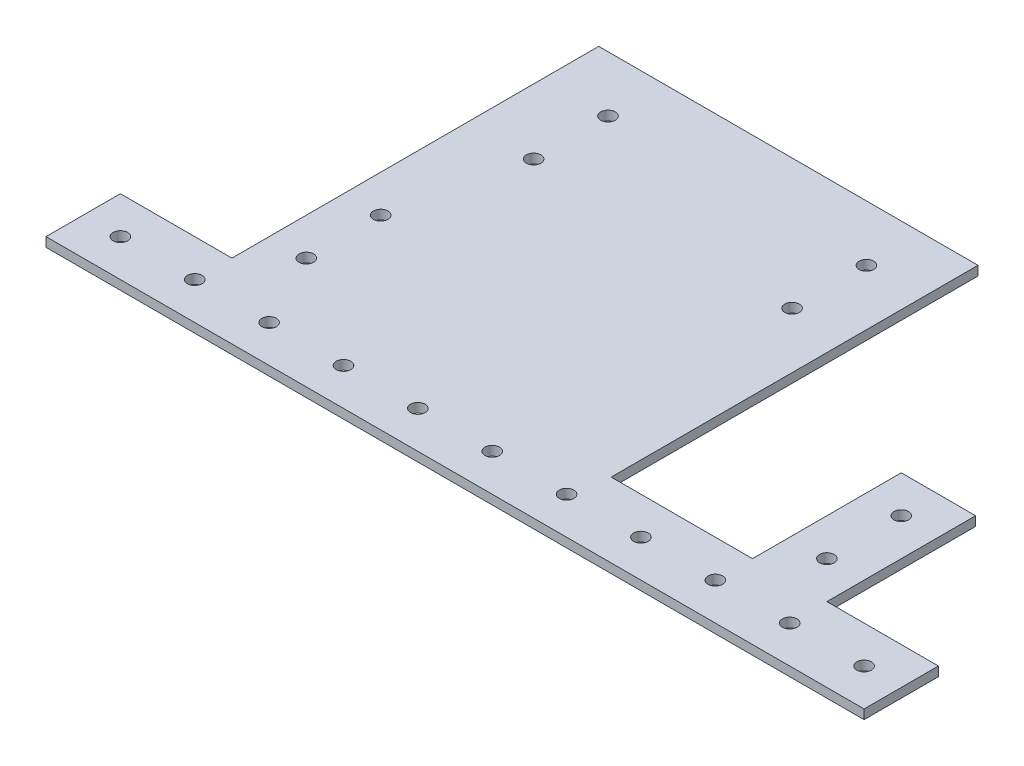
ISO-10303-21;
HEADER;
FILE_DESCRIPTION(('STEP AP214'),'2;1');
FILE_NAME('part.step','',(''),(''),'','','');
FILE_SCHEMA(('AUTOMOTIVE_DESIGN { 1 0 10303 214 1 1 1 1 }'));
ENDSEC;
DATA;
#1=APPLICATION_CONTEXT('core data for automotive mechanical design processes');
#2=APPLICATION_PROTOCOL_DEFINITION('international standard','automotive_design',2000,#1);
#3=PRODUCT_CONTEXT('',#1,'mechanical');
#4=PRODUCT('Part','Part','',(#3));
#5=PRODUCT_RELATED_PRODUCT_CATEGORY('part','',(#4));
#6=PRODUCT_DEFINITION_FORMATION('','',#4);
#7=PRODUCT_DEFINITION_CONTEXT('part definition',#1,'design');
#8=PRODUCT_DEFINITION('design','',#6,#7);
#9=PRODUCT_DEFINITION_SHAPE('','',#8);
#10=(LENGTH_UNIT() NAMED_UNIT(*) SI_UNIT(.MILLI.,.METRE.));
#11=(NAMED_UNIT(*) PLANE_ANGLE_UNIT() SI_UNIT($,.RADIAN.));
#12=(NAMED_UNIT(*) SI_UNIT($,.STERADIAN.) SOLID_ANGLE_UNIT());
#13=UNCERTAINTY_MEASURE_WITH_UNIT(LENGTH_MEASURE(1.E-05),#10,'distance_accuracy_value','');
#14=(GEOMETRIC_REPRESENTATION_CONTEXT(3) GLOBAL_UNCERTAINTY_ASSIGNED_CONTEXT((#13)) GLOBAL_UNIT_ASSIGNED_CONTEXT((#10,
#11,#12)) REPRESENTATION_CONTEXT('',''));
#15=CARTESIAN_POINT('',(0.,0.,0.));
#16=DIRECTION('',(0.,0.,1.));
#17=DIRECTION('',(1.,0.,0.));
#18=AXIS2_PLACEMENT_3D('',#15,#16,#17);
#19=CARTESIAN_POINT('',(0.,3.175,0.));
#20=DIRECTION('',(0.,-1.,0.));
#21=DIRECTION('',(0.,0.,-1.));
#22=AXIS2_PLACEMENT_3D('',#19,#20,#21);
#23=PLANE('',#22);
#24=DIRECTION('',(0.,0.,1.));
#25=VECTOR('',#24,1.);
#26=CARTESIAN_POINT('',(-101.6,3.175,-25.4));
#27=LINE('',#26,#25);
#28=CARTESIAN_POINT('',(-101.6,3.175,-150.6728));
#29=VERTEX_POINT('',#28);
#30=CARTESIAN_POINT('',(-101.6,3.175,-25.4));
#31=VERTEX_POINT('',#30);
#32=EDGE_CURVE('E177',#29,#31,#27,.T.);
#33=ORIENTED_EDGE('',*,*,#32,.T.);
#34=DIRECTION('',(-1.,0.,0.));
#35=VECTOR('',#34,1.);
#36=CARTESIAN_POINT('',(-139.7,3.175,-25.4));
#37=LINE('',#36,#35);
#38=CARTESIAN_POINT('',(-139.7,3.175,-25.4));
#39=VERTEX_POINT('',#38);
#40=EDGE_CURVE('E105',#31,#39,#37,.T.);
#41=ORIENTED_EDGE('',*,*,#40,.T.);
#42=DIRECTION('',(0.,0.,1.));
#43=VECTOR('',#42,1.);
#44=CARTESIAN_POINT('',(-139.7,3.175,0.));
#45=LINE('',#44,#43);
#46=CARTESIAN_POINT('',(-139.7,3.175,0.));
#47=VERTEX_POINT('',#46);
#48=EDGE_CURVE('E204',#39,#47,#45,.T.);
#49=ORIENTED_EDGE('',*,*,#48,.T.);
#50=DIRECTION('',(1.,0.,0.));
#51=VECTOR('',#50,1.);
#52=CARTESIAN_POINT('',(139.7,3.175,0.));
#53=LINE('',#52,#51);
#54=CARTESIAN_POINT('',(139.7,3.175,0.));
#55=VERTEX_POINT('',#54);
#56=EDGE_CURVE('E223',#47,#55,#53,.T.);
#57=ORIENTED_EDGE('',*,*,#56,.T.);
#58=DIRECTION('',(0.,0.,-1.));
#59=VECTOR('',#58,1.);
#60=CARTESIAN_POINT('',(139.7,3.175,0.));
#61=LINE('',#60,#59);
#62=CARTESIAN_POINT('',(139.7,3.175,-25.4000000000001));
#63=VERTEX_POINT('',#62);
#64=EDGE_CURVE('E220',#55,#63,#61,.T.);
#65=ORIENTED_EDGE('',*,*,#64,.T.);
#66=DIRECTION('',(-1.,0.,0.));
#67=VECTOR('',#66,1.);
#68=CARTESIAN_POINT('',(139.7,3.175,-25.4000000000001));
#69=LINE('',#68,#67);
#70=CARTESIAN_POINT('',(101.6,3.175,-25.4));
#71=VERTEX_POINT('',#70);
#72=EDGE_CURVE('E222',#63,#71,#69,.T.);
#73=ORIENTED_EDGE('',*,*,#72,.T.);
#74=DIRECTION('',(0.,0.,-1.));
#75=VECTOR('',#74,1.);
#76=CARTESIAN_POINT('',(101.6,3.175,-25.4));
#77=LINE('',#76,#75);
#78=CARTESIAN_POINT('',(101.6,3.175,-76.2));
#79=VERTEX_POINT('',#78);
#80=EDGE_CURVE('E225',#71,#79,#77,.T.);
#81=ORIENTED_EDGE('',*,*,#80,.T.);
#82=DIRECTION('',(-1.,0.,0.));
#83=VECTOR('',#82,1.);
#84=CARTESIAN_POINT('',(76.1999999999999,3.175,-76.2));
#85=LINE('',#84,#83);
#86=CARTESIAN_POINT('',(76.1999999999999,3.175,-76.2));
#87=VERTEX_POINT('',#86);
#88=EDGE_CURVE('E231',#79,#87,#85,.T.);
#89=ORIENTED_EDGE('',*,*,#88,.T.);
#90=DIRECTION('',(0.,0.,1.));
#91=VECTOR('',#90,1.);
#92=CARTESIAN_POINT('',(76.1999999999999,3.175,-25.4));
#93=LINE('',#92,#91);
#94=CARTESIAN_POINT('',(76.1999999999999,3.175,-25.4));
#95=VERTEX_POINT('',#94);
#96=EDGE_CURVE('E136',#87,#95,#93,.T.);
#97=ORIENTED_EDGE('',*,*,#96,.T.);
#98=DIRECTION('',(-1.,0.,0.));
#99=VECTOR('',#98,1.);
#100=CARTESIAN_POINT('',(27.9400000000001,3.175,-25.3999999999999));
#101=LINE('',#100,#99);
#102=CARTESIAN_POINT('',(27.9400000000001,3.175,-25.3999999999999));
#103=VERTEX_POINT('',#102);
#104=EDGE_CURVE('E130',#95,#103,#101,.T.);
#105=ORIENTED_EDGE('',*,*,#104,.T.);
#106=DIRECTION('',(0.,0.,-1.));
#107=VECTOR('',#106,1.);
#108=CARTESIAN_POINT('',(27.9399999999999,3.175,-150.6728));
#109=LINE('',#108,#107);
#110=CARTESIAN_POINT('',(27.9399999999999,3.175,-150.6728));
#111=VERTEX_POINT('',#110);
#112=EDGE_CURVE('E134',#103,#111,#109,.T.);
#113=ORIENTED_EDGE('',*,*,#112,.T.);
#114=DIRECTION('',(-1.,0.,0.));
#115=VECTOR('',#114,1.);
#116=CARTESIAN_POINT('',(-101.6,3.175,-150.6728));
#117=LINE('',#116,#115);
#118=EDGE_CURVE('E50',#111,#29,#117,.T.);
#119=ORIENTED_EDGE('',*,*,#118,.T.);
#120=EDGE_LOOP('',(#33,#41,#49,#57,#65,#73,#81,#89,#97,#105,#113,#119));
#121=FACE_BOUND('',#120,.T.);
#122=CARTESIAN_POINT('',(-127.,3.175,-12.7));
#123=DIRECTION('',(0.,1.,0.));
#124=DIRECTION('',(0.,0.,1.));
#125=AXIS2_PLACEMENT_3D('',#122,#123,#124);
#126=CIRCLE('',#125,2.4892);
#127=CARTESIAN_POINT('',(-127.,3.175,-10.2108));
#128=VERTEX_POINT('',#127);
#129=EDGE_CURVE('E158',#128,#128,#126,.T.);
#130=ORIENTED_EDGE('',*,*,#129,.F.);
#131=EDGE_LOOP('',(#130));
#132=FACE_BOUND('',#131,.T.);
#133=CARTESIAN_POINT('',(-88.8999999999999,3.175,-38.1));
#134=DIRECTION('',(0.,1.,0.));
#135=DIRECTION('',(0.,0.,1.));
#136=AXIS2_PLACEMENT_3D('',#133,#134,#135);
#137=CIRCLE('',#136,2.4892);
#138=CARTESIAN_POINT('',(-88.8999999999999,3.175,-35.6108));
#139=VERTEX_POINT('',#138);
#140=EDGE_CURVE('E445',#139,#139,#137,.T.);
#141=ORIENTED_EDGE('',*,*,#140,.F.);
#142=EDGE_LOOP('',(#141));
#143=FACE_BOUND('',#142,.T.);
#144=CARTESIAN_POINT('',(-88.8999999999999,3.175,-63.5));
#145=DIRECTION('',(0.,1.,0.));
#146=DIRECTION('',(0.,0.,1.));
#147=AXIS2_PLACEMENT_3D('',#144,#145,#146);
#148=CIRCLE('',#147,2.4892);
#149=CARTESIAN_POINT('',(-88.8999999999999,3.175,-61.0108));
#150=VERTEX_POINT('',#149);
#151=EDGE_CURVE('E439',#150,#150,#148,.T.);
#152=ORIENTED_EDGE('',*,*,#151,.F.);
#153=EDGE_LOOP('',(#152));
#154=FACE_BOUND('',#153,.T.);
#155=CARTESIAN_POINT('',(-79.375,3.175,-131.6228));
#156=DIRECTION('',(0.,1.,0.));
#157=DIRECTION('',(0.,0.,1.));
#158=AXIS2_PLACEMENT_3D('',#155,#156,#157);
#159=CIRCLE('',#158,2.48920000000002);
#160=CARTESIAN_POINT('',(-79.375,3.175,-129.1336));
#161=VERTEX_POINT('',#160);
#162=EDGE_CURVE('E433',#161,#161,#159,.T.);
#163=ORIENTED_EDGE('',*,*,#162,.F.);
#164=EDGE_LOOP('',(#163));
#165=FACE_BOUND('',#164,.T.);
#166=CARTESIAN_POINT('',(-79.375,3.175,-106.2228));
#167=DIRECTION('',(0.,1.,0.));
#168=DIRECTION('',(0.,0.,1.));
#169=AXIS2_PLACEMENT_3D('',#166,#167,#168);
#170=CIRCLE('',#169,2.4892);
#171=CARTESIAN_POINT('',(-79.375,3.175,-103.7336));
#172=VERTEX_POINT('',#171);
#173=EDGE_CURVE('E427',#172,#172,#170,.T.);
#174=ORIENTED_EDGE('',*,*,#173,.F.);
#175=EDGE_LOOP('',(#174));
#176=FACE_BOUND('',#175,.T.);
#177=CARTESIAN_POINT('',(8.88999999999996,3.175,-106.2228));
#178=DIRECTION('',(0.,1.,0.));
#179=DIRECTION('',(0.,0.,1.));
#180=AXIS2_PLACEMENT_3D('',#177,#178,#179);
#181=CIRCLE('',#180,2.48919999999999);
#182=CARTESIAN_POINT('',(8.88999999999996,3.175,-103.7336));
#183=VERTEX_POINT('',#182);
#184=EDGE_CURVE('E421',#183,#183,#181,.T.);
#185=ORIENTED_EDGE('',*,*,#184,.F.);
#186=EDGE_LOOP('',(#185));
#187=FACE_BOUND('',#186,.T.);
#188=CARTESIAN_POINT('',(8.88999999999995,3.175,-131.6228));
#189=DIRECTION('',(0.,1.,0.));
#190=DIRECTION('',(0.,0.,1.));
#191=AXIS2_PLACEMENT_3D('',#188,#189,#190);
#192=CIRCLE('',#191,2.48920000000002);
#193=CARTESIAN_POINT('',(8.88999999999995,3.175,-129.1336));
#194=VERTEX_POINT('',#193);
#195=EDGE_CURVE('E415',#194,#194,#192,.T.);
#196=ORIENTED_EDGE('',*,*,#195,.F.);
#197=EDGE_LOOP('',(#196));
#198=FACE_BOUND('',#197,.T.);
#199=CARTESIAN_POINT('',(88.8999999999999,3.175,-63.5));
#200=DIRECTION('',(0.,1.,0.));
#201=DIRECTION('',(0.,0.,1.));
#202=AXIS2_PLACEMENT_3D('',#199,#200,#201);
#203=CIRCLE('',#202,2.48920000000002);
#204=CARTESIAN_POINT('',(88.8999999999999,3.175,-61.0108));
#205=VERTEX_POINT('',#204);
#206=EDGE_CURVE('E409',#205,#205,#203,.T.);
#207=ORIENTED_EDGE('',*,*,#206,.F.);
#208=EDGE_LOOP('',(#207));
#209=FACE_BOUND('',#208,.T.);
#210=CARTESIAN_POINT('',(88.8999999999999,3.175,-38.1));
#211=DIRECTION('',(0.,1.,0.));
#212=DIRECTION('',(0.,0.,1.));
#213=AXIS2_PLACEMENT_3D('',#210,#211,#212);
#214=CIRCLE('',#213,2.4892);
#215=CARTESIAN_POINT('',(88.8999999999999,3.175,-35.6108));
#216=VERTEX_POINT('',#215);
#217=EDGE_CURVE('E403',#216,#216,#214,.T.);
#218=ORIENTED_EDGE('',*,*,#217,.F.);
#219=EDGE_LOOP('',(#218));
#220=FACE_BOUND('',#219,.T.);
#221=CARTESIAN_POINT('',(-101.6,3.175,-12.7));
#222=DIRECTION('',(0.,1.,0.));
#223=DIRECTION('',(0.,0.,1.));
#224=AXIS2_PLACEMENT_3D('',#221,#222,#223);
#225=CIRCLE('',#224,2.4892);
#226=CARTESIAN_POINT('',(-101.6,3.175,-10.2108));
#227=VERTEX_POINT('',#226);
#228=EDGE_CURVE('E397',#227,#227,#225,.T.);
#229=ORIENTED_EDGE('',*,*,#228,.F.);
#230=EDGE_LOOP('',(#229));
#231=FACE_BOUND('',#230,.T.);
#232=CARTESIAN_POINT('',(-76.2,3.175,-12.7));
#233=DIRECTION('',(0.,1.,0.));
#234=DIRECTION('',(0.,0.,1.));
#235=AXIS2_PLACEMENT_3D('',#232,#233,#234);
#236=CIRCLE('',#235,2.4892);
#237=CARTESIAN_POINT('',(-76.2,3.175,-10.2108));
#238=VERTEX_POINT('',#237);
#239=EDGE_CURVE('E391',#238,#238,#236,.T.);
#240=ORIENTED_EDGE('',*,*,#239,.F.);
#241=EDGE_LOOP('',(#240));
#242=FACE_BOUND('',#241,.T.);
#243=CARTESIAN_POINT('',(-50.8,3.175,-12.7));
#244=DIRECTION('',(0.,1.,0.));
#245=DIRECTION('',(0.,0.,1.));
#246=AXIS2_PLACEMENT_3D('',#243,#244,#245);
#247=CIRCLE('',#246,2.4892);
#248=CARTESIAN_POINT('',(-50.8,3.175,-10.2108));
#249=VERTEX_POINT('',#248);
#250=EDGE_CURVE('E385',#249,#249,#247,.T.);
#251=ORIENTED_EDGE('',*,*,#250,.F.);
#252=EDGE_LOOP('',(#251));
#253=FACE_BOUND('',#252,.T.);
#254=CARTESIAN_POINT('',(-25.4,3.175,-12.7));
#255=DIRECTION('',(0.,1.,0.));
#256=DIRECTION('',(0.,0.,1.));
#257=AXIS2_PLACEMENT_3D('',#254,#255,#256);
#258=CIRCLE('',#257,2.4892);
#259=CARTESIAN_POINT('',(-25.4,3.175,-10.2108));
#260=VERTEX_POINT('',#259);
#261=EDGE_CURVE('E379',#260,#260,#258,.T.);
#262=ORIENTED_EDGE('',*,*,#261,.F.);
#263=EDGE_LOOP('',(#262));
#264=FACE_BOUND('',#263,.T.);
#265=CARTESIAN_POINT('',(0.,3.175,-12.7));
#266=DIRECTION('',(0.,1.,0.));
#267=DIRECTION('',(0.,0.,1.));
#268=AXIS2_PLACEMENT_3D('',#265,#266,#267);
#269=CIRCLE('',#268,2.4892);
#270=CARTESIAN_POINT('',(0.,3.175,-10.2108));
#271=VERTEX_POINT('',#270);
#272=EDGE_CURVE('E373',#271,#271,#269,.T.);
#273=ORIENTED_EDGE('',*,*,#272,.F.);
#274=EDGE_LOOP('',(#273));
#275=FACE_BOUND('',#274,.T.);
#276=CARTESIAN_POINT('',(25.4,3.175,-12.7));
#277=DIRECTION('',(0.,1.,0.));
#278=DIRECTION('',(0.,0.,1.));
#279=AXIS2_PLACEMENT_3D('',#276,#277,#278);
#280=CIRCLE('',#279,2.4892);
#281=CARTESIAN_POINT('',(25.4,3.175,-10.2108));
#282=VERTEX_POINT('',#281);
#283=EDGE_CURVE('E367',#282,#282,#280,.T.);
#284=ORIENTED_EDGE('',*,*,#283,.F.);
#285=EDGE_LOOP('',(#284));
#286=FACE_BOUND('',#285,.T.);
#287=CARTESIAN_POINT('',(50.8,3.175,-12.7));
#288=DIRECTION('',(0.,1.,0.));
#289=DIRECTION('',(0.,0.,1.));
#290=AXIS2_PLACEMENT_3D('',#287,#288,#289);
#291=CIRCLE('',#290,2.4892);
#292=CARTESIAN_POINT('',(50.8,3.175,-10.2108));
#293=VERTEX_POINT('',#292);
#294=EDGE_CURVE('E361',#293,#293,#291,.T.);
#295=ORIENTED_EDGE('',*,*,#294,.F.);
#296=EDGE_LOOP('',(#295));
#297=FACE_BOUND('',#296,.T.);
#298=CARTESIAN_POINT('',(76.2,3.175,-12.7));
#299=DIRECTION('',(0.,1.,0.));
#300=DIRECTION('',(0.,0.,1.));
#301=AXIS2_PLACEMENT_3D('',#298,#299,#300);
#302=CIRCLE('',#301,2.4892);
#303=CARTESIAN_POINT('',(76.2,3.175,-10.2108));
#304=VERTEX_POINT('',#303);
#305=EDGE_CURVE('E355',#304,#304,#302,.T.);
#306=ORIENTED_EDGE('',*,*,#305,.F.);
#307=EDGE_LOOP('',(#306));
#308=FACE_BOUND('',#307,.T.);
#309=CARTESIAN_POINT('',(101.6,3.175,-12.7));
#310=DIRECTION('',(0.,1.,0.));
#311=DIRECTION('',(0.,0.,1.));
#312=AXIS2_PLACEMENT_3D('',#309,#310,#311);
#313=CIRCLE('',#312,2.4892);
#314=CARTESIAN_POINT('',(101.6,3.175,-10.2108));
#315=VERTEX_POINT('',#314);
#316=EDGE_CURVE('E349',#315,#315,#313,.T.);
#317=ORIENTED_EDGE('',*,*,#316,.F.);
#318=EDGE_LOOP('',(#317));
#319=FACE_BOUND('',#318,.T.);
#320=CARTESIAN_POINT('',(127.,3.175,-12.7));
#321=DIRECTION('',(0.,1.,0.));
#322=DIRECTION('',(0.,0.,1.));
#323=AXIS2_PLACEMENT_3D('',#320,#321,#322);
#324=CIRCLE('',#323,2.4892);
#325=CARTESIAN_POINT('',(127.,3.175,-10.2108));
#326=VERTEX_POINT('',#325);
#327=EDGE_CURVE('E340',#326,#326,#324,.T.);
#328=ORIENTED_EDGE('',*,*,#327,.F.);
#329=EDGE_LOOP('',(#328));
#330=FACE_BOUND('',#329,.T.);
#331=ADVANCED_FACE('F33',(#121,#132,#143,#154,#165,#176,#187,#198,#209,#220,#231,#242,#253,#264,
#275,#286,#297,#308,#319,#330),#23,.F.);
#332=CARTESIAN_POINT('',(0.,0.,0.));
#333=DIRECTION('',(0.,-1.,0.));
#334=DIRECTION('',(0.,0.,-1.));
#335=AXIS2_PLACEMENT_3D('',#332,#333,#334);
#336=PLANE('',#335);
#337=CARTESIAN_POINT('',(101.6,0.,-12.7));
#338=DIRECTION('',(0.,1.,0.));
#339=DIRECTION('',(0.,0.,1.));
#340=AXIS2_PLACEMENT_3D('',#337,#338,#339);
#341=CIRCLE('',#340,2.4892);
#342=CARTESIAN_POINT('',(101.6,0.,-10.2108));
#343=VERTEX_POINT('',#342);
#344=EDGE_CURVE('E346',#343,#343,#341,.T.);
#345=ORIENTED_EDGE('',*,*,#344,.T.);
#346=EDGE_LOOP('',(#345));
#347=FACE_BOUND('',#346,.T.);
#348=CARTESIAN_POINT('',(50.8,0.,-12.7));
#349=DIRECTION('',(0.,1.,0.));
#350=DIRECTION('',(0.,0.,1.));
#351=AXIS2_PLACEMENT_3D('',#348,#349,#350);
#352=CIRCLE('',#351,2.4892);
#353=CARTESIAN_POINT('',(50.8,0.,-10.2108));
#354=VERTEX_POINT('',#353);
#355=EDGE_CURVE('E358',#354,#354,#352,.T.);
#356=ORIENTED_EDGE('',*,*,#355,.T.);
#357=EDGE_LOOP('',(#356));
#358=FACE_BOUND('',#357,.T.);
#359=CARTESIAN_POINT('',(0.,0.,-12.7));
#360=DIRECTION('',(0.,1.,0.));
#361=DIRECTION('',(0.,0.,1.));
#362=AXIS2_PLACEMENT_3D('',#359,#360,#361);
#363=CIRCLE('',#362,2.4892);
#364=CARTESIAN_POINT('',(0.,0.,-10.2108));
#365=VERTEX_POINT('',#364);
#366=EDGE_CURVE('E370',#365,#365,#363,.T.);
#367=ORIENTED_EDGE('',*,*,#366,.T.);
#368=EDGE_LOOP('',(#367));
#369=FACE_BOUND('',#368,.T.);
#370=CARTESIAN_POINT('',(-50.8,0.,-12.7));
#371=DIRECTION('',(0.,1.,0.));
#372=DIRECTION('',(0.,0.,1.));
#373=AXIS2_PLACEMENT_3D('',#370,#371,#372);
#374=CIRCLE('',#373,2.4892);
#375=CARTESIAN_POINT('',(-50.8,0.,-10.2108));
#376=VERTEX_POINT('',#375);
#377=EDGE_CURVE('E382',#376,#376,#374,.T.);
#378=ORIENTED_EDGE('',*,*,#377,.T.);
#379=EDGE_LOOP('',(#378));
#380=FACE_BOUND('',#379,.T.);
#381=CARTESIAN_POINT('',(-101.6,0.,-12.7));
#382=DIRECTION('',(0.,1.,0.));
#383=DIRECTION('',(0.,0.,1.));
#384=AXIS2_PLACEMENT_3D('',#381,#382,#383);
#385=CIRCLE('',#384,2.4892);
#386=CARTESIAN_POINT('',(-101.6,0.,-10.2108));
#387=VERTEX_POINT('',#386);
#388=EDGE_CURVE('E394',#387,#387,#385,.T.);
#389=ORIENTED_EDGE('',*,*,#388,.T.);
#390=EDGE_LOOP('',(#389));
#391=FACE_BOUND('',#390,.T.);
#392=CARTESIAN_POINT('',(88.8999999999999,0.,-63.5));
#393=DIRECTION('',(0.,1.,0.));
#394=DIRECTION('',(0.,0.,1.));
#395=AXIS2_PLACEMENT_3D('',#392,#393,#394);
#396=CIRCLE('',#395,2.48920000000002);
#397=CARTESIAN_POINT('',(88.8999999999999,0.,-61.0108));
#398=VERTEX_POINT('',#397);
#399=EDGE_CURVE('E406',#398,#398,#396,.T.);
#400=ORIENTED_EDGE('',*,*,#399,.T.);
#401=EDGE_LOOP('',(#400));
#402=FACE_BOUND('',#401,.T.);
#403=CARTESIAN_POINT('',(8.88999999999996,0.,-106.2228));
#404=DIRECTION('',(0.,1.,0.));
#405=DIRECTION('',(0.,0.,1.));
#406=AXIS2_PLACEMENT_3D('',#403,#404,#405);
#407=CIRCLE('',#406,2.48919999999999);
#408=CARTESIAN_POINT('',(8.88999999999996,0.,-103.7336));
#409=VERTEX_POINT('',#408);
#410=EDGE_CURVE('E418',#409,#409,#407,.T.);
#411=ORIENTED_EDGE('',*,*,#410,.T.);
#412=EDGE_LOOP('',(#411));
#413=FACE_BOUND('',#412,.T.);
#414=CARTESIAN_POINT('',(-79.375,0.,-131.6228));
#415=DIRECTION('',(0.,1.,0.));
#416=DIRECTION('',(0.,0.,1.));
#417=AXIS2_PLACEMENT_3D('',#414,#415,#416);
#418=CIRCLE('',#417,2.48920000000002);
#419=CARTESIAN_POINT('',(-79.375,0.,-129.1336));
#420=VERTEX_POINT('',#419);
#421=EDGE_CURVE('E430',#420,#420,#418,.T.);
#422=ORIENTED_EDGE('',*,*,#421,.T.);
#423=EDGE_LOOP('',(#422));
#424=FACE_BOUND('',#423,.T.);
#425=CARTESIAN_POINT('',(-88.8999999999999,0.,-38.1));
#426=DIRECTION('',(0.,1.,0.));
#427=DIRECTION('',(0.,0.,1.));
#428=AXIS2_PLACEMENT_3D('',#425,#426,#427);
#429=CIRCLE('',#428,2.4892);
#430=CARTESIAN_POINT('',(-88.8999999999999,0.,-35.6108));
#431=VERTEX_POINT('',#430);
#432=EDGE_CURVE('E442',#431,#431,#429,.T.);
#433=ORIENTED_EDGE('',*,*,#432,.T.);
#434=EDGE_LOOP('',(#433));
#435=FACE_BOUND('',#434,.T.);
#436=DIRECTION('',(0.,0.,1.));
#437=VECTOR('',#436,1.);
#438=CARTESIAN_POINT('',(-101.6,0.,-25.4));
#439=LINE('',#438,#437);
#440=CARTESIAN_POINT('',(-101.6,0.,-150.6728));
#441=VERTEX_POINT('',#440);
#442=CARTESIAN_POINT('',(-101.6,0.,-25.4));
#443=VERTEX_POINT('',#442);
#444=EDGE_CURVE('E154',#441,#443,#439,.T.);
#445=ORIENTED_EDGE('',*,*,#444,.F.);
#446=DIRECTION('',(-1.,0.,0.));
#447=VECTOR('',#446,1.);
#448=CARTESIAN_POINT('',(-101.6,0.,-150.6728));
#449=LINE('',#448,#447);
#450=CARTESIAN_POINT('',(27.9399999999999,0.,-150.6728));
#451=VERTEX_POINT('',#450);
#452=EDGE_CURVE('E97',#451,#441,#449,.T.);
#453=ORIENTED_EDGE('',*,*,#452,.F.);
#454=DIRECTION('',(0.,0.,-1.));
#455=VECTOR('',#454,1.);
#456=CARTESIAN_POINT('',(27.9399999999999,0.,-150.6728));
#457=LINE('',#456,#455);
#458=CARTESIAN_POINT('',(27.9400000000001,0.,-25.3999999999999));
#459=VERTEX_POINT('',#458);
#460=EDGE_CURVE('E91',#459,#451,#457,.T.);
#461=ORIENTED_EDGE('',*,*,#460,.F.);
#462=DIRECTION('',(-1.,0.,0.));
#463=VECTOR('',#462,1.);
#464=CARTESIAN_POINT('',(27.9400000000001,0.,-25.3999999999999));
#465=LINE('',#464,#463);
#466=CARTESIAN_POINT('',(76.1999999999999,0.,-25.4));
#467=VERTEX_POINT('',#466);
#468=EDGE_CURVE('E144',#467,#459,#465,.T.);
#469=ORIENTED_EDGE('',*,*,#468,.F.);
#470=DIRECTION('',(0.,0.,1.));
#471=VECTOR('',#470,1.);
#472=CARTESIAN_POINT('',(76.1999999999999,0.,-25.4));
#473=LINE('',#472,#471);
#474=CARTESIAN_POINT('',(76.1999999999999,0.,-76.2));
#475=VERTEX_POINT('',#474);
#476=EDGE_CURVE('E172',#475,#467,#473,.T.);
#477=ORIENTED_EDGE('',*,*,#476,.F.);
#478=DIRECTION('',(-1.,0.,0.));
#479=VECTOR('',#478,1.);
#480=CARTESIAN_POINT('',(76.1999999999999,0.,-76.2));
#481=LINE('',#480,#479);
#482=CARTESIAN_POINT('',(101.6,0.,-76.2));
#483=VERTEX_POINT('',#482);
#484=EDGE_CURVE('E170',#483,#475,#481,.T.);
#485=ORIENTED_EDGE('',*,*,#484,.F.);
#486=DIRECTION('',(0.,0.,-1.));
#487=VECTOR('',#486,1.);
#488=CARTESIAN_POINT('',(101.6,0.,-25.4));
#489=LINE('',#488,#487);
#490=CARTESIAN_POINT('',(101.6,0.,-25.4));
#491=VERTEX_POINT('',#490);
#492=EDGE_CURVE('E168',#491,#483,#489,.T.);
#493=ORIENTED_EDGE('',*,*,#492,.F.);
#494=DIRECTION('',(-1.,0.,0.));
#495=VECTOR('',#494,1.);
#496=CARTESIAN_POINT('',(139.7,0.,-25.4000000000001));
#497=LINE('',#496,#495);
#498=CARTESIAN_POINT('',(139.7,0.,-25.4000000000001));
#499=VERTEX_POINT('',#498);
#500=EDGE_CURVE('E166',#499,#491,#497,.T.);
#501=ORIENTED_EDGE('',*,*,#500,.F.);
#502=DIRECTION('',(0.,0.,-1.));
#503=VECTOR('',#502,1.);
#504=CARTESIAN_POINT('',(139.7,0.,0.));
#505=LINE('',#504,#503);
#506=CARTESIAN_POINT('',(139.7,0.,0.));
#507=VERTEX_POINT('',#506);
#508=EDGE_CURVE('E164',#507,#499,#505,.T.);
#509=ORIENTED_EDGE('',*,*,#508,.F.);
#510=DIRECTION('',(1.,0.,0.));
#511=VECTOR('',#510,1.);
#512=CARTESIAN_POINT('',(139.7,0.,0.));
#513=LINE('',#512,#511);
#514=CARTESIAN_POINT('',(-139.7,0.,0.));
#515=VERTEX_POINT('',#514);
#516=EDGE_CURVE('E162',#515,#507,#513,.T.);
#517=ORIENTED_EDGE('',*,*,#516,.F.);
#518=DIRECTION('',(0.,0.,1.));
#519=VECTOR('',#518,1.);
#520=CARTESIAN_POINT('',(-139.7,0.,0.));
#521=LINE('',#520,#519);
#522=CARTESIAN_POINT('',(-139.7,0.,-25.4));
#523=VERTEX_POINT('',#522);
#524=EDGE_CURVE('E160',#523,#515,#521,.T.);
#525=ORIENTED_EDGE('',*,*,#524,.F.);
#526=DIRECTION('',(-1.,0.,0.));
#527=VECTOR('',#526,1.);
#528=CARTESIAN_POINT('',(-139.7,0.,-25.4));
#529=LINE('',#528,#527);
#530=EDGE_CURVE('E157',#443,#523,#529,.T.);
#531=ORIENTED_EDGE('',*,*,#530,.F.);
#532=EDGE_LOOP('',(#445,#453,#461,#469,#477,#485,#493,#501,#509,#517,#525,#531));
#533=FACE_BOUND('',#532,.T.);
#534=CARTESIAN_POINT('',(-127.,0.,-12.7));
#535=DIRECTION('',(0.,1.,0.));
#536=DIRECTION('',(0.,0.,1.));
#537=AXIS2_PLACEMENT_3D('',#534,#535,#536);
#538=CIRCLE('',#537,2.4892);
#539=CARTESIAN_POINT('',(-127.,0.,-10.2108));
#540=VERTEX_POINT('',#539);
#541=EDGE_CURVE('E448',#540,#540,#538,.T.);
#542=ORIENTED_EDGE('',*,*,#541,.T.);
#543=EDGE_LOOP('',(#542));
#544=FACE_BOUND('',#543,.T.);
#545=CARTESIAN_POINT('',(-88.8999999999999,0.,-63.5));
#546=DIRECTION('',(0.,1.,0.));
#547=DIRECTION('',(0.,0.,1.));
#548=AXIS2_PLACEMENT_3D('',#545,#546,#547);
#549=CIRCLE('',#548,2.4892);
#550=CARTESIAN_POINT('',(-88.8999999999999,0.,-61.0108));
#551=VERTEX_POINT('',#550);
#552=EDGE_CURVE('E436',#551,#551,#549,.T.);
#553=ORIENTED_EDGE('',*,*,#552,.T.);
#554=EDGE_LOOP('',(#553));
#555=FACE_BOUND('',#554,.T.);
#556=CARTESIAN_POINT('',(-79.375,0.,-106.2228));
#557=DIRECTION('',(0.,1.,0.));
#558=DIRECTION('',(0.,0.,1.));
#559=AXIS2_PLACEMENT_3D('',#556,#557,#558);
#560=CIRCLE('',#559,2.4892);
#561=CARTESIAN_POINT('',(-79.375,0.,-103.7336));
#562=VERTEX_POINT('',#561);
#563=EDGE_CURVE('E424',#562,#562,#560,.T.);
#564=ORIENTED_EDGE('',*,*,#563,.T.);
#565=EDGE_LOOP('',(#564));
#566=FACE_BOUND('',#565,.T.);
#567=CARTESIAN_POINT('',(8.88999999999995,0.,-131.6228));
#568=DIRECTION('',(0.,1.,0.));
#569=DIRECTION('',(0.,0.,1.));
#570=AXIS2_PLACEMENT_3D('',#567,#568,#569);
#571=CIRCLE('',#570,2.48920000000002);
#572=CARTESIAN_POINT('',(8.88999999999995,0.,-129.1336));
#573=VERTEX_POINT('',#572);
#574=EDGE_CURVE('E412',#573,#573,#571,.T.);
#575=ORIENTED_EDGE('',*,*,#574,.T.);
#576=EDGE_LOOP('',(#575));
#577=FACE_BOUND('',#576,.T.);
#578=CARTESIAN_POINT('',(88.8999999999999,0.,-38.1));
#579=DIRECTION('',(0.,1.,0.));
#580=DIRECTION('',(0.,0.,1.));
#581=AXIS2_PLACEMENT_3D('',#578,#579,#580);
#582=CIRCLE('',#581,2.4892);
#583=CARTESIAN_POINT('',(88.8999999999999,0.,-35.6108));
#584=VERTEX_POINT('',#583);
#585=EDGE_CURVE('E400',#584,#584,#582,.T.);
#586=ORIENTED_EDGE('',*,*,#585,.T.);
#587=EDGE_LOOP('',(#586));
#588=FACE_BOUND('',#587,.T.);
#589=CARTESIAN_POINT('',(-76.2,0.,-12.7));
#590=DIRECTION('',(0.,1.,0.));
#591=DIRECTION('',(0.,0.,1.));
#592=AXIS2_PLACEMENT_3D('',#589,#590,#591);
#593=CIRCLE('',#592,2.4892);
#594=CARTESIAN_POINT('',(-76.2,0.,-10.2108));
#595=VERTEX_POINT('',#594);
#596=EDGE_CURVE('E388',#595,#595,#593,.T.);
#597=ORIENTED_EDGE('',*,*,#596,.T.);
#598=EDGE_LOOP('',(#597));
#599=FACE_BOUND('',#598,.T.);
#600=CARTESIAN_POINT('',(-25.4,0.,-12.7));
#601=DIRECTION('',(0.,1.,0.));
#602=DIRECTION('',(0.,0.,1.));
#603=AXIS2_PLACEMENT_3D('',#600,#601,#602);
#604=CIRCLE('',#603,2.4892);
#605=CARTESIAN_POINT('',(-25.4,0.,-10.2108));
#606=VERTEX_POINT('',#605);
#607=EDGE_CURVE('E376',#606,#606,#604,.T.);
#608=ORIENTED_EDGE('',*,*,#607,.T.);
#609=EDGE_LOOP('',(#608));
#610=FACE_BOUND('',#609,.T.);
#611=CARTESIAN_POINT('',(25.4,0.,-12.7));
#612=DIRECTION('',(0.,1.,0.));
#613=DIRECTION('',(0.,0.,1.));
#614=AXIS2_PLACEMENT_3D('',#611,#612,#613);
#615=CIRCLE('',#614,2.4892);
#616=CARTESIAN_POINT('',(25.4,0.,-10.2108));
#617=VERTEX_POINT('',#616);
#618=EDGE_CURVE('E364',#617,#617,#615,.T.);
#619=ORIENTED_EDGE('',*,*,#618,.T.);
#620=EDGE_LOOP('',(#619));
#621=FACE_BOUND('',#620,.T.);
#622=CARTESIAN_POINT('',(76.2,0.,-12.7));
#623=DIRECTION('',(0.,1.,0.));
#624=DIRECTION('',(0.,0.,1.));
#625=AXIS2_PLACEMENT_3D('',#622,#623,#624);
#626=CIRCLE('',#625,2.4892);
#627=CARTESIAN_POINT('',(76.2,0.,-10.2108));
#628=VERTEX_POINT('',#627);
#629=EDGE_CURVE('E352',#628,#628,#626,.T.);
#630=ORIENTED_EDGE('',*,*,#629,.T.);
#631=EDGE_LOOP('',(#630));
#632=FACE_BOUND('',#631,.T.);
#633=CARTESIAN_POINT('',(127.,0.,-12.7));
#634=DIRECTION('',(0.,1.,0.));
#635=DIRECTION('',(0.,0.,1.));
#636=AXIS2_PLACEMENT_3D('',#633,#634,#635);
#637=CIRCLE('',#636,2.4892);
#638=CARTESIAN_POINT('',(127.,0.,-10.2108));
#639=VERTEX_POINT('',#638);
#640=EDGE_CURVE('E343',#639,#639,#637,.T.);
#641=ORIENTED_EDGE('',*,*,#640,.T.);
#642=EDGE_LOOP('',(#641));
#643=FACE_BOUND('',#642,.T.);
#644=ADVANCED_FACE('F208',(#347,#358,#369,#380,#391,#402,#413,#424,#435,#533,#544,#555,#566,
#577,#588,#599,#610,#621,#632,#643),#336,.T.);
#645=CARTESIAN_POINT('',(-101.6,3.175,-25.4));
#646=DIRECTION('',(1.,0.,0.));
#647=DIRECTION('',(0.,0.,-1.));
#648=AXIS2_PLACEMENT_3D('',#645,#646,#647);
#649=PLANE('',#648);
#650=ORIENTED_EDGE('',*,*,#444,.T.);
#651=DIRECTION('',(0.,-1.,0.));
#652=VECTOR('',#651,1.);
#653=CARTESIAN_POINT('',(-101.6,3.175,-25.4));
#654=LINE('',#653,#652);
#655=EDGE_CURVE('E11',#31,#443,#654,.T.);
#656=ORIENTED_EDGE('',*,*,#655,.F.);
#657=ORIENTED_EDGE('',*,*,#32,.F.);
#658=DIRECTION('',(0.,-1.,0.));
#659=VECTOR('',#658,1.);
#660=CARTESIAN_POINT('',(-101.6,3.175,-150.6728));
#661=LINE('',#660,#659);
#662=EDGE_CURVE('E150',#29,#441,#661,.T.);
#663=ORIENTED_EDGE('',*,*,#662,.T.);
#664=EDGE_LOOP('',(#650,#656,#657,#663));
#665=FACE_BOUND('',#664,.T.);
#666=ADVANCED_FACE('F35',(#665),#649,.F.);
#667=CARTESIAN_POINT('',(-139.7,3.175,-25.4));
#668=DIRECTION('',(0.,0.,1.));
#669=DIRECTION('',(1.,0.,0.));
#670=AXIS2_PLACEMENT_3D('',#667,#668,#669);
#671=PLANE('',#670);
#672=ORIENTED_EDGE('',*,*,#530,.T.);
#673=DIRECTION('',(0.,-1.,0.));
#674=VECTOR('',#673,1.);
#675=CARTESIAN_POINT('',(-139.7,3.175,-25.4));
#676=LINE('',#675,#674);
#677=EDGE_CURVE('E42',#39,#523,#676,.T.);
#678=ORIENTED_EDGE('',*,*,#677,.F.);
#679=ORIENTED_EDGE('',*,*,#40,.F.);
#680=ORIENTED_EDGE('',*,*,#655,.T.);
#681=EDGE_LOOP('',(#672,#678,#679,#680));
#682=FACE_BOUND('',#681,.T.);
#683=ADVANCED_FACE('F695',(#682),#671,.F.);
#684=CARTESIAN_POINT('',(-139.7,3.175,0.));
#685=DIRECTION('',(1.,0.,0.));
#686=DIRECTION('',(0.,0.,-1.));
#687=AXIS2_PLACEMENT_3D('',#684,#685,#686);
#688=PLANE('',#687);
#689=ORIENTED_EDGE('',*,*,#524,.T.);
#690=DIRECTION('',(0.,-1.,0.));
#691=VECTOR('',#690,1.);
#692=CARTESIAN_POINT('',(-139.7,3.175,0.));
#693=LINE('',#692,#691);
#694=EDGE_CURVE('E196',#47,#515,#693,.T.);
#695=ORIENTED_EDGE('',*,*,#694,.F.);
#696=ORIENTED_EDGE('',*,*,#48,.F.);
#697=ORIENTED_EDGE('',*,*,#677,.T.);
#698=EDGE_LOOP('',(#689,#695,#696,#697));
#699=FACE_BOUND('',#698,.T.);
#700=ADVANCED_FACE('F202',(#699),#688,.F.);
#701=CARTESIAN_POINT('',(139.7,3.175,0.));
#702=DIRECTION('',(0.,0.,-1.));
#703=DIRECTION('',(-1.,0.,0.));
#704=AXIS2_PLACEMENT_3D('',#701,#702,#703);
#705=PLANE('',#704);
#706=ORIENTED_EDGE('',*,*,#516,.T.);
#707=DIRECTION('',(0.,-1.,0.));
#708=VECTOR('',#707,1.);
#709=CARTESIAN_POINT('',(139.7,3.175,0.));
#710=LINE('',#709,#708);
#711=EDGE_CURVE('E193',#55,#507,#710,.T.);
#712=ORIENTED_EDGE('',*,*,#711,.F.);
#713=ORIENTED_EDGE('',*,*,#56,.F.);
#714=ORIENTED_EDGE('',*,*,#694,.T.);
#715=EDGE_LOOP('',(#706,#712,#713,#714));
#716=FACE_BOUND('',#715,.T.);
#717=ADVANCED_FACE('F214',(#716),#705,.F.);
#718=CARTESIAN_POINT('',(139.7,3.175,0.));
#719=DIRECTION('',(-1.,0.,0.));
#720=DIRECTION('',(0.,0.,1.));
#721=AXIS2_PLACEMENT_3D('',#718,#719,#720);
#722=PLANE('',#721);
#723=ORIENTED_EDGE('',*,*,#508,.T.);
#724=DIRECTION('',(0.,-1.,0.));
#725=VECTOR('',#724,1.);
#726=CARTESIAN_POINT('',(139.7,3.175,-25.4000000000001));
#727=LINE('',#726,#725);
#728=EDGE_CURVE('E190',#63,#499,#727,.T.);
#729=ORIENTED_EDGE('',*,*,#728,.F.);
#730=ORIENTED_EDGE('',*,*,#64,.F.);
#731=ORIENTED_EDGE('',*,*,#711,.T.);
#732=EDGE_LOOP('',(#723,#729,#730,#731));
#733=FACE_BOUND('',#732,.T.);
#734=ADVANCED_FACE('F218',(#733),#722,.F.);
#735=CARTESIAN_POINT('',(139.7,3.175,-25.4000000000001));
#736=DIRECTION('',(0.,0.,1.));
#737=DIRECTION('',(1.,0.,0.));
#738=AXIS2_PLACEMENT_3D('',#735,#736,#737);
#739=PLANE('',#738);
#740=ORIENTED_EDGE('',*,*,#500,.T.);
#741=DIRECTION('',(0.,-1.,0.));
#742=VECTOR('',#741,1.);
#743=CARTESIAN_POINT('',(101.6,3.175,-25.4));
#744=LINE('',#743,#742);
#745=EDGE_CURVE('E187',#71,#491,#744,.T.);
#746=ORIENTED_EDGE('',*,*,#745,.F.);
#747=ORIENTED_EDGE('',*,*,#72,.F.);
#748=ORIENTED_EDGE('',*,*,#728,.T.);
#749=EDGE_LOOP('',(#740,#746,#747,#748));
#750=FACE_BOUND('',#749,.T.);
#751=ADVANCED_FACE('F660',(#750),#739,.F.);
#752=CARTESIAN_POINT('',(101.6,3.175,-25.4));
#753=DIRECTION('',(-1.,0.,0.));
#754=DIRECTION('',(0.,0.,1.));
#755=AXIS2_PLACEMENT_3D('',#752,#753,#754);
#756=PLANE('',#755);
#757=ORIENTED_EDGE('',*,*,#492,.T.);
#758=DIRECTION('',(0.,-1.,0.));
#759=VECTOR('',#758,1.);
#760=CARTESIAN_POINT('',(101.6,3.175,-76.2));
#761=LINE('',#760,#759);
#762=EDGE_CURVE('E184',#79,#483,#761,.T.);
#763=ORIENTED_EDGE('',*,*,#762,.F.);
#764=ORIENTED_EDGE('',*,*,#80,.F.);
#765=ORIENTED_EDGE('',*,*,#745,.T.);
#766=EDGE_LOOP('',(#757,#763,#764,#765));
#767=FACE_BOUND('',#766,.T.);
#768=ADVANCED_FACE('F651',(#767),#756,.F.);
#769=CARTESIAN_POINT('',(76.1999999999999,3.175,-76.2));
#770=DIRECTION('',(0.,0.,1.));
#771=DIRECTION('',(1.,0.,0.));
#772=AXIS2_PLACEMENT_3D('',#769,#770,#771);
#773=PLANE('',#772);
#774=ORIENTED_EDGE('',*,*,#484,.T.);
#775=DIRECTION('',(0.,-1.,0.));
#776=VECTOR('',#775,1.);
#777=CARTESIAN_POINT('',(76.1999999999999,3.175,-76.2));
#778=LINE('',#777,#776);
#779=EDGE_CURVE('E181',#87,#475,#778,.T.);
#780=ORIENTED_EDGE('',*,*,#779,.F.);
#781=ORIENTED_EDGE('',*,*,#88,.F.);
#782=ORIENTED_EDGE('',*,*,#762,.T.);
#783=EDGE_LOOP('',(#774,#780,#781,#782));
#784=FACE_BOUND('',#783,.T.);
#785=ADVANCED_FACE('F237',(#784),#773,.F.);
#786=CARTESIAN_POINT('',(76.1999999999999,3.175,-25.4));
#787=DIRECTION('',(1.,0.,0.));
#788=DIRECTION('',(0.,0.,-1.));
#789=AXIS2_PLACEMENT_3D('',#786,#787,#788);
#790=PLANE('',#789);
#791=ORIENTED_EDGE('',*,*,#476,.T.);
#792=DIRECTION('',(0.,-1.,0.));
#793=VECTOR('',#792,1.);
#794=CARTESIAN_POINT('',(76.1999999999999,3.175,-25.4));
#795=LINE('',#794,#793);
#796=EDGE_CURVE('E145',#95,#467,#795,.T.);
#797=ORIENTED_EDGE('',*,*,#796,.F.);
#798=ORIENTED_EDGE('',*,*,#96,.F.);
#799=ORIENTED_EDGE('',*,*,#779,.T.);
#800=EDGE_LOOP('',(#791,#797,#798,#799));
#801=FACE_BOUND('',#800,.T.);
#802=ADVANCED_FACE('F241',(#801),#790,.F.);
#803=CARTESIAN_POINT('',(27.9400000000001,3.175,-25.3999999999999));
#804=DIRECTION('',(0.,0.,1.));
#805=DIRECTION('',(1.,0.,0.));
#806=AXIS2_PLACEMENT_3D('',#803,#804,#805);
#807=PLANE('',#806);
#808=ORIENTED_EDGE('',*,*,#468,.T.);
#809=DIRECTION('',(0.,-1.,0.));
#810=VECTOR('',#809,1.);
#811=CARTESIAN_POINT('',(27.9400000000001,3.175,-25.3999999999999));
#812=LINE('',#811,#810);
#813=EDGE_CURVE('E141',#103,#459,#812,.T.);
#814=ORIENTED_EDGE('',*,*,#813,.F.);
#815=ORIENTED_EDGE('',*,*,#104,.F.);
#816=ORIENTED_EDGE('',*,*,#796,.T.);
#817=EDGE_LOOP('',(#808,#814,#815,#816));
#818=FACE_BOUND('',#817,.T.);
#819=ADVANCED_FACE('F142',(#818),#807,.F.);
#820=CARTESIAN_POINT('',(27.9399999999999,3.175,-150.6728));
#821=DIRECTION('',(-1.,0.,0.));
#822=DIRECTION('',(0.,0.,1.));
#823=AXIS2_PLACEMENT_3D('',#820,#821,#822);
#824=PLANE('',#823);
#825=ORIENTED_EDGE('',*,*,#460,.T.);
#826=DIRECTION('',(0.,-1.,0.));
#827=VECTOR('',#826,1.);
#828=CARTESIAN_POINT('',(27.9399999999999,3.175,-150.6728));
#829=LINE('',#828,#827);
#830=EDGE_CURVE('E146',#111,#451,#829,.T.);
#831=ORIENTED_EDGE('',*,*,#830,.F.);
#832=ORIENTED_EDGE('',*,*,#112,.F.);
#833=ORIENTED_EDGE('',*,*,#813,.T.);
#834=EDGE_LOOP('',(#825,#831,#832,#833));
#835=FACE_BOUND('',#834,.T.);
#836=ADVANCED_FACE('F148',(#835),#824,.F.);
#837=CARTESIAN_POINT('',(-101.6,3.175,-150.6728));
#838=DIRECTION('',(0.,0.,1.));
#839=DIRECTION('',(1.,0.,0.));
#840=AXIS2_PLACEMENT_3D('',#837,#838,#839);
#841=PLANE('',#840);
#842=ORIENTED_EDGE('',*,*,#452,.T.);
#843=ORIENTED_EDGE('',*,*,#662,.F.);
#844=ORIENTED_EDGE('',*,*,#118,.F.);
#845=ORIENTED_EDGE('',*,*,#830,.T.);
#846=EDGE_LOOP('',(#842,#843,#844,#845));
#847=FACE_BOUND('',#846,.T.);
#848=ADVANCED_FACE('F245',(#847),#841,.F.);
#849=CARTESIAN_POINT('',(-127.,3.175,-12.7));
#850=DIRECTION('',(0.,-1.,0.));
#851=DIRECTION('',(0.,0.,-1.));
#852=AXIS2_PLACEMENT_3D('',#849,#850,#851);
#853=CYLINDRICAL_SURFACE('',#852,2.4892);
#854=ORIENTED_EDGE('',*,*,#129,.T.);
#855=EDGE_LOOP('',(#854));
#856=FACE_BOUND('',#855,.T.);
#857=ORIENTED_EDGE('',*,*,#541,.F.);
#858=EDGE_LOOP('',(#857));
#859=FACE_BOUND('',#858,.T.);
#860=ADVANCED_FACE('F247',(#856,#859),#853,.F.);
#861=CARTESIAN_POINT('',(-88.8999999999999,3.175,-38.1));
#862=DIRECTION('',(0.,-1.,0.));
#863=DIRECTION('',(0.,0.,-1.));
#864=AXIS2_PLACEMENT_3D('',#861,#862,#863);
#865=CYLINDRICAL_SURFACE('',#864,2.4892);
#866=ORIENTED_EDGE('',*,*,#140,.T.);
#867=EDGE_LOOP('',(#866));
#868=FACE_BOUND('',#867,.T.);
#869=ORIENTED_EDGE('',*,*,#432,.F.);
#870=EDGE_LOOP('',(#869));
#871=FACE_BOUND('',#870,.T.);
#872=ADVANCED_FACE('F253',(#868,#871),#865,.F.);
#873=CARTESIAN_POINT('',(-88.8999999999999,3.175,-63.5));
#874=DIRECTION('',(0.,-1.,0.));
#875=DIRECTION('',(0.,0.,-1.));
#876=AXIS2_PLACEMENT_3D('',#873,#874,#875);
#877=CYLINDRICAL_SURFACE('',#876,2.4892);
#878=ORIENTED_EDGE('',*,*,#151,.T.);
#879=EDGE_LOOP('',(#878));
#880=FACE_BOUND('',#879,.T.);
#881=ORIENTED_EDGE('',*,*,#552,.F.);
#882=EDGE_LOOP('',(#881));
#883=FACE_BOUND('',#882,.T.);
#884=ADVANCED_FACE('F267',(#880,#883),#877,.F.);
#885=CARTESIAN_POINT('',(-79.375,3.175,-131.6228));
#886=DIRECTION('',(0.,-1.,0.));
#887=DIRECTION('',(0.,0.,-1.));
#888=AXIS2_PLACEMENT_3D('',#885,#886,#887);
#889=CYLINDRICAL_SURFACE('',#888,2.48920000000002);
#890=ORIENTED_EDGE('',*,*,#162,.T.);
#891=EDGE_LOOP('',(#890));
#892=FACE_BOUND('',#891,.T.);
#893=ORIENTED_EDGE('',*,*,#421,.F.);
#894=EDGE_LOOP('',(#893));
#895=FACE_BOUND('',#894,.T.);
#896=ADVANCED_FACE('F271',(#892,#895),#889,.F.);
#897=CARTESIAN_POINT('',(-79.375,3.175,-106.2228));
#898=DIRECTION('',(0.,-1.,0.));
#899=DIRECTION('',(0.,0.,-1.));
#900=AXIS2_PLACEMENT_3D('',#897,#898,#899);
#901=CYLINDRICAL_SURFACE('',#900,2.4892);
#902=ORIENTED_EDGE('',*,*,#173,.T.);
#903=EDGE_LOOP('',(#902));
#904=FACE_BOUND('',#903,.T.);
#905=ORIENTED_EDGE('',*,*,#563,.F.);
#906=EDGE_LOOP('',(#905));
#907=FACE_BOUND('',#906,.T.);
#908=ADVANCED_FACE('F275',(#904,#907),#901,.F.);
#909=CARTESIAN_POINT('',(8.88999999999996,3.175,-106.2228));
#910=DIRECTION('',(0.,-1.,0.));
#911=DIRECTION('',(0.,0.,-1.));
#912=AXIS2_PLACEMENT_3D('',#909,#910,#911);
#913=CYLINDRICAL_SURFACE('',#912,2.48919999999999);
#914=ORIENTED_EDGE('',*,*,#184,.T.);
#915=EDGE_LOOP('',(#914));
#916=FACE_BOUND('',#915,.T.);
#917=ORIENTED_EDGE('',*,*,#410,.F.);
#918=EDGE_LOOP('',(#917));
#919=FACE_BOUND('',#918,.T.);
#920=ADVANCED_FACE('F279',(#916,#919),#913,.F.);
#921=CARTESIAN_POINT('',(8.88999999999995,3.175,-131.6228));
#922=DIRECTION('',(0.,-1.,0.));
#923=DIRECTION('',(0.,0.,-1.));
#924=AXIS2_PLACEMENT_3D('',#921,#922,#923);
#925=CYLINDRICAL_SURFACE('',#924,2.48920000000002);
#926=ORIENTED_EDGE('',*,*,#195,.T.);
#927=EDGE_LOOP('',(#926));
#928=FACE_BOUND('',#927,.T.);
#929=ORIENTED_EDGE('',*,*,#574,.F.);
#930=EDGE_LOOP('',(#929));
#931=FACE_BOUND('',#930,.T.);
#932=ADVANCED_FACE('F283',(#928,#931),#925,.F.);
#933=CARTESIAN_POINT('',(88.8999999999999,3.175,-63.5));
#934=DIRECTION('',(0.,-1.,0.));
#935=DIRECTION('',(0.,0.,-1.));
#936=AXIS2_PLACEMENT_3D('',#933,#934,#935);
#937=CYLINDRICAL_SURFACE('',#936,2.48920000000002);
#938=ORIENTED_EDGE('',*,*,#206,.T.);
#939=EDGE_LOOP('',(#938));
#940=FACE_BOUND('',#939,.T.);
#941=ORIENTED_EDGE('',*,*,#399,.F.);
#942=EDGE_LOOP('',(#941));
#943=FACE_BOUND('',#942,.T.);
#944=ADVANCED_FACE('F287',(#940,#943),#937,.F.);
#945=CARTESIAN_POINT('',(88.8999999999999,3.175,-38.1));
#946=DIRECTION('',(0.,-1.,0.));
#947=DIRECTION('',(0.,0.,-1.));
#948=AXIS2_PLACEMENT_3D('',#945,#946,#947);
#949=CYLINDRICAL_SURFACE('',#948,2.4892);
#950=ORIENTED_EDGE('',*,*,#217,.T.);
#951=EDGE_LOOP('',(#950));
#952=FACE_BOUND('',#951,.T.);
#953=ORIENTED_EDGE('',*,*,#585,.F.);
#954=EDGE_LOOP('',(#953));
#955=FACE_BOUND('',#954,.T.);
#956=ADVANCED_FACE('F291',(#952,#955),#949,.F.);
#957=CARTESIAN_POINT('',(-101.6,3.175,-12.7));
#958=DIRECTION('',(0.,-1.,0.));
#959=DIRECTION('',(0.,0.,-1.));
#960=AXIS2_PLACEMENT_3D('',#957,#958,#959);
#961=CYLINDRICAL_SURFACE('',#960,2.4892);
#962=ORIENTED_EDGE('',*,*,#228,.T.);
#963=EDGE_LOOP('',(#962));
#964=FACE_BOUND('',#963,.T.);
#965=ORIENTED_EDGE('',*,*,#388,.F.);
#966=EDGE_LOOP('',(#965));
#967=FACE_BOUND('',#966,.T.);
#968=ADVANCED_FACE('F295',(#964,#967),#961,.F.);
#969=CARTESIAN_POINT('',(-76.2,3.175,-12.7));
#970=DIRECTION('',(0.,-1.,0.));
#971=DIRECTION('',(0.,0.,-1.));
#972=AXIS2_PLACEMENT_3D('',#969,#970,#971);
#973=CYLINDRICAL_SURFACE('',#972,2.4892);
#974=ORIENTED_EDGE('',*,*,#239,.T.);
#975=EDGE_LOOP('',(#974));
#976=FACE_BOUND('',#975,.T.);
#977=ORIENTED_EDGE('',*,*,#596,.F.);
#978=EDGE_LOOP('',(#977));
#979=FACE_BOUND('',#978,.T.);
#980=ADVANCED_FACE('F299',(#976,#979),#973,.F.);
#981=CARTESIAN_POINT('',(-50.8,3.175,-12.7));
#982=DIRECTION('',(0.,-1.,0.));
#983=DIRECTION('',(0.,0.,-1.));
#984=AXIS2_PLACEMENT_3D('',#981,#982,#983);
#985=CYLINDRICAL_SURFACE('',#984,2.4892);
#986=ORIENTED_EDGE('',*,*,#250,.T.);
#987=EDGE_LOOP('',(#986));
#988=FACE_BOUND('',#987,.T.);
#989=ORIENTED_EDGE('',*,*,#377,.F.);
#990=EDGE_LOOP('',(#989));
#991=FACE_BOUND('',#990,.T.);
#992=ADVANCED_FACE('F303',(#988,#991),#985,.F.);
#993=CARTESIAN_POINT('',(-25.4,3.175,-12.7));
#994=DIRECTION('',(0.,-1.,0.));
#995=DIRECTION('',(0.,0.,-1.));
#996=AXIS2_PLACEMENT_3D('',#993,#994,#995);
#997=CYLINDRICAL_SURFACE('',#996,2.4892);
#998=ORIENTED_EDGE('',*,*,#261,.T.);
#999=EDGE_LOOP('',(#998));
#1000=FACE_BOUND('',#999,.T.);
#1001=ORIENTED_EDGE('',*,*,#607,.F.);
#1002=EDGE_LOOP('',(#1001));
#1003=FACE_BOUND('',#1002,.T.);
#1004=ADVANCED_FACE('F307',(#1000,#1003),#997,.F.);
#1005=CARTESIAN_POINT('',(0.,3.175,-12.7));
#1006=DIRECTION('',(0.,-1.,0.));
#1007=DIRECTION('',(0.,0.,-1.));
#1008=AXIS2_PLACEMENT_3D('',#1005,#1006,#1007);
#1009=CYLINDRICAL_SURFACE('',#1008,2.4892);
#1010=ORIENTED_EDGE('',*,*,#272,.T.);
#1011=EDGE_LOOP('',(#1010));
#1012=FACE_BOUND('',#1011,.T.);
#1013=ORIENTED_EDGE('',*,*,#366,.F.);
#1014=EDGE_LOOP('',(#1013));
#1015=FACE_BOUND('',#1014,.T.);
#1016=ADVANCED_FACE('F311',(#1012,#1015),#1009,.F.);
#1017=CARTESIAN_POINT('',(25.4,3.175,-12.7));
#1018=DIRECTION('',(0.,-1.,0.));
#1019=DIRECTION('',(0.,0.,-1.));
#1020=AXIS2_PLACEMENT_3D('',#1017,#1018,#1019);
#1021=CYLINDRICAL_SURFACE('',#1020,2.4892);
#1022=ORIENTED_EDGE('',*,*,#283,.T.);
#1023=EDGE_LOOP('',(#1022));
#1024=FACE_BOUND('',#1023,.T.);
#1025=ORIENTED_EDGE('',*,*,#618,.F.);
#1026=EDGE_LOOP('',(#1025));
#1027=FACE_BOUND('',#1026,.T.);
#1028=ADVANCED_FACE('F315',(#1024,#1027),#1021,.F.);
#1029=CARTESIAN_POINT('',(50.8,3.175,-12.7));
#1030=DIRECTION('',(0.,-1.,0.));
#1031=DIRECTION('',(0.,0.,-1.));
#1032=AXIS2_PLACEMENT_3D('',#1029,#1030,#1031);
#1033=CYLINDRICAL_SURFACE('',#1032,2.4892);
#1034=ORIENTED_EDGE('',*,*,#294,.T.);
#1035=EDGE_LOOP('',(#1034));
#1036=FACE_BOUND('',#1035,.T.);
#1037=ORIENTED_EDGE('',*,*,#355,.F.);
#1038=EDGE_LOOP('',(#1037));
#1039=FACE_BOUND('',#1038,.T.);
#1040=ADVANCED_FACE('F319',(#1036,#1039),#1033,.F.);
#1041=CARTESIAN_POINT('',(76.2,3.175,-12.7));
#1042=DIRECTION('',(0.,-1.,0.));
#1043=DIRECTION('',(0.,0.,-1.));
#1044=AXIS2_PLACEMENT_3D('',#1041,#1042,#1043);
#1045=CYLINDRICAL_SURFACE('',#1044,2.4892);
#1046=ORIENTED_EDGE('',*,*,#305,.T.);
#1047=EDGE_LOOP('',(#1046));
#1048=FACE_BOUND('',#1047,.T.);
#1049=ORIENTED_EDGE('',*,*,#629,.F.);
#1050=EDGE_LOOP('',(#1049));
#1051=FACE_BOUND('',#1050,.T.);
#1052=ADVANCED_FACE('F323',(#1048,#1051),#1045,.F.);
#1053=CARTESIAN_POINT('',(101.6,3.175,-12.7));
#1054=DIRECTION('',(0.,-1.,0.));
#1055=DIRECTION('',(0.,0.,-1.));
#1056=AXIS2_PLACEMENT_3D('',#1053,#1054,#1055);
#1057=CYLINDRICAL_SURFACE('',#1056,2.4892);
#1058=ORIENTED_EDGE('',*,*,#316,.T.);
#1059=EDGE_LOOP('',(#1058));
#1060=FACE_BOUND('',#1059,.T.);
#1061=ORIENTED_EDGE('',*,*,#344,.F.);
#1062=EDGE_LOOP('',(#1061));
#1063=FACE_BOUND('',#1062,.T.);
#1064=ADVANCED_FACE('F327',(#1060,#1063),#1057,.F.);
#1065=CARTESIAN_POINT('',(127.,3.175,-12.7));
#1066=DIRECTION('',(0.,-1.,0.));
#1067=DIRECTION('',(0.,0.,-1.));
#1068=AXIS2_PLACEMENT_3D('',#1065,#1066,#1067);
#1069=CYLINDRICAL_SURFACE('',#1068,2.4892);
#1070=ORIENTED_EDGE('',*,*,#327,.T.);
#1071=EDGE_LOOP('',(#1070));
#1072=FACE_BOUND('',#1071,.T.);
#1073=ORIENTED_EDGE('',*,*,#640,.F.);
#1074=EDGE_LOOP('',(#1073));
#1075=FACE_BOUND('',#1074,.T.);
#1076=ADVANCED_FACE('F331',(#1072,#1075),#1069,.F.);
#1077=CLOSED_SHELL('',(#331,#644,#666,#683,#700,#717,#734,#751,#768,#785,#802,#819,#836,#848,
#860,#872,#884,#896,#908,#920,#932,#944,#956,#968,#980,#992,#1004,#1016,#1028,#1040,#1052,#1064,#1076));
#1078=MANIFOLD_SOLID_BREP('B2',#1077);
#1079=ADVANCED_BREP_SHAPE_REPRESENTATION('',(#18,#1078),#14);
#1080=SHAPE_DEFINITION_REPRESENTATION(#9,#1079);
ENDSEC;
END-ISO-10303-21;
